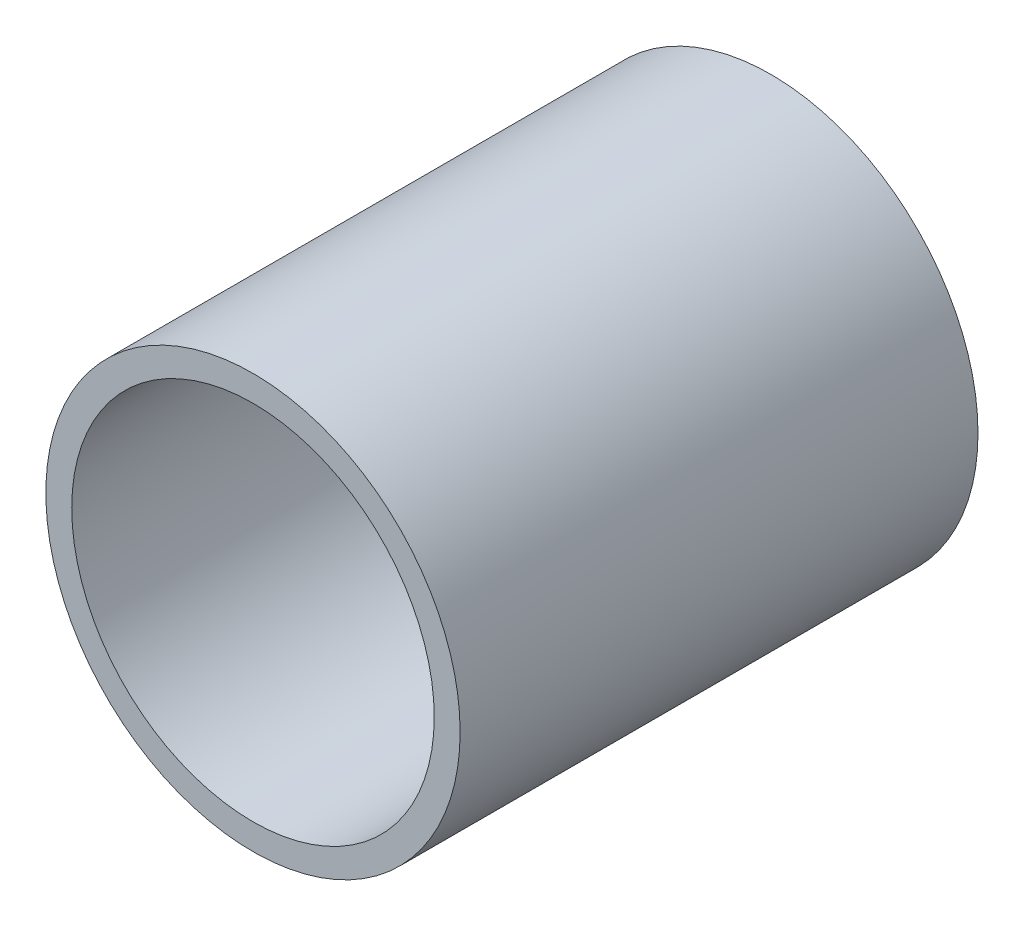
ISO-10303-21;
HEADER;
FILE_DESCRIPTION(('STEP AP214'),'2;1');
FILE_NAME('part.step','',(''),(''),'','','');
FILE_SCHEMA(('AUTOMOTIVE_DESIGN { 1 0 10303 214 1 1 1 1 }'));
ENDSEC;
DATA;
#1=APPLICATION_CONTEXT('core data for automotive mechanical design processes');
#2=APPLICATION_PROTOCOL_DEFINITION('international standard','automotive_design',2000,#1);
#3=PRODUCT_CONTEXT('',#1,'mechanical');
#4=PRODUCT('Part','Part','',(#3));
#5=PRODUCT_RELATED_PRODUCT_CATEGORY('part','',(#4));
#6=PRODUCT_DEFINITION_FORMATION('','',#4);
#7=PRODUCT_DEFINITION_CONTEXT('part definition',#1,'design');
#8=PRODUCT_DEFINITION('design','',#6,#7);
#9=PRODUCT_DEFINITION_SHAPE('','',#8);
#10=(LENGTH_UNIT() NAMED_UNIT(*) SI_UNIT(.MILLI.,.METRE.));
#11=(NAMED_UNIT(*) PLANE_ANGLE_UNIT() SI_UNIT($,.RADIAN.));
#12=(NAMED_UNIT(*) SI_UNIT($,.STERADIAN.) SOLID_ANGLE_UNIT());
#13=UNCERTAINTY_MEASURE_WITH_UNIT(LENGTH_MEASURE(1.E-05),#10,'distance_accuracy_value','');
#14=(GEOMETRIC_REPRESENTATION_CONTEXT(3) GLOBAL_UNCERTAINTY_ASSIGNED_CONTEXT((#13)) GLOBAL_UNIT_ASSIGNED_CONTEXT((#10,
#11,#12)) REPRESENTATION_CONTEXT('',''));
#15=CARTESIAN_POINT('',(0.,0.,0.));
#16=DIRECTION('',(0.,0.,1.));
#17=DIRECTION('',(1.,0.,0.));
#18=AXIS2_PLACEMENT_3D('',#15,#16,#17);
#19=CARTESIAN_POINT('',(0.,0.,10.));
#20=DIRECTION('',(0.,0.,1.));
#21=DIRECTION('',(1.,0.,0.));
#22=AXIS2_PLACEMENT_3D('',#19,#20,#21);
#23=PLANE('',#22);
#24=CARTESIAN_POINT('',(0.,0.,10.));
#25=DIRECTION('',(0.,0.,1.));
#26=DIRECTION('',(1.,0.,0.));
#27=AXIS2_PLACEMENT_3D('',#24,#25,#26);
#28=CIRCLE('',#27,4.);
#29=CARTESIAN_POINT('',(4.,0.,10.));
#30=VERTEX_POINT('',#29);
#31=EDGE_CURVE('E10',#30,#30,#28,.T.);
#32=ORIENTED_EDGE('',*,*,#31,.T.);
#33=EDGE_LOOP('',(#32));
#34=FACE_BOUND('',#33,.T.);
#35=CARTESIAN_POINT('',(0.,0.,10.));
#36=DIRECTION('',(0.,0.,1.));
#37=DIRECTION('',(1.,0.,0.));
#38=AXIS2_PLACEMENT_3D('',#35,#36,#37);
#39=CIRCLE('',#38,3.5);
#40=CARTESIAN_POINT('',(3.5,0.,10.));
#41=VERTEX_POINT('',#40);
#42=EDGE_CURVE('E43',#41,#41,#39,.T.);
#43=ORIENTED_EDGE('',*,*,#42,.F.);
#44=EDGE_LOOP('',(#43));
#45=FACE_BOUND('',#44,.T.);
#46=ADVANCED_FACE('F32',(#34,#45),#23,.T.);
#47=CARTESIAN_POINT('',(0.,0.,0.));
#48=DIRECTION('',(0.,0.,1.));
#49=DIRECTION('',(1.,0.,0.));
#50=AXIS2_PLACEMENT_3D('',#47,#48,#49);
#51=PLANE('',#50);
#52=CARTESIAN_POINT('',(0.,0.,0.));
#53=DIRECTION('',(0.,0.,1.));
#54=DIRECTION('',(1.,0.,0.));
#55=AXIS2_PLACEMENT_3D('',#52,#53,#54);
#56=CIRCLE('',#55,4.);
#57=CARTESIAN_POINT('',(4.,0.,0.));
#58=VERTEX_POINT('',#57);
#59=EDGE_CURVE('E36',#58,#58,#56,.T.);
#60=ORIENTED_EDGE('',*,*,#59,.F.);
#61=EDGE_LOOP('',(#60));
#62=FACE_BOUND('',#61,.T.);
#63=CARTESIAN_POINT('',(0.,0.,0.));
#64=DIRECTION('',(0.,0.,1.));
#65=DIRECTION('',(1.,0.,0.));
#66=AXIS2_PLACEMENT_3D('',#63,#64,#65);
#67=CIRCLE('',#66,3.5);
#68=CARTESIAN_POINT('',(3.5,0.,0.));
#69=VERTEX_POINT('',#68);
#70=EDGE_CURVE('E45',#69,#69,#67,.T.);
#71=ORIENTED_EDGE('',*,*,#70,.T.);
#72=EDGE_LOOP('',(#71));
#73=FACE_BOUND('',#72,.T.);
#74=ADVANCED_FACE('F55',(#62,#73),#51,.F.);
#75=CARTESIAN_POINT('',(0.,0.,10.));
#76=DIRECTION('',(0.,0.,-1.));
#77=DIRECTION('',(-1.,0.,0.));
#78=AXIS2_PLACEMENT_3D('',#75,#76,#77);
#79=CYLINDRICAL_SURFACE('',#78,4.);
#80=ORIENTED_EDGE('',*,*,#31,.F.);
#81=EDGE_LOOP('',(#80));
#82=FACE_BOUND('',#81,.T.);
#83=ORIENTED_EDGE('',*,*,#59,.T.);
#84=EDGE_LOOP('',(#83));
#85=FACE_BOUND('',#84,.T.);
#86=ADVANCED_FACE('F34',(#82,#85),#79,.T.);
#87=CARTESIAN_POINT('',(0.,0.,10.));
#88=DIRECTION('',(0.,0.,-1.));
#89=DIRECTION('',(-1.,0.,0.));
#90=AXIS2_PLACEMENT_3D('',#87,#88,#89);
#91=CYLINDRICAL_SURFACE('',#90,3.5);
#92=ORIENTED_EDGE('',*,*,#42,.T.);
#93=EDGE_LOOP('',(#92));
#94=FACE_BOUND('',#93,.T.);
#95=ORIENTED_EDGE('',*,*,#70,.F.);
#96=EDGE_LOOP('',(#95));
#97=FACE_BOUND('',#96,.T.);
#98=ADVANCED_FACE('F51',(#94,#97),#91,.F.);
#99=CLOSED_SHELL('',(#46,#74,#86,#98));
#100=MANIFOLD_SOLID_BREP('B2',#99);
#101=ADVANCED_BREP_SHAPE_REPRESENTATION('',(#18,#100),#14);
#102=SHAPE_DEFINITION_REPRESENTATION(#9,#101);
ENDSEC;
END-ISO-10303-21;
